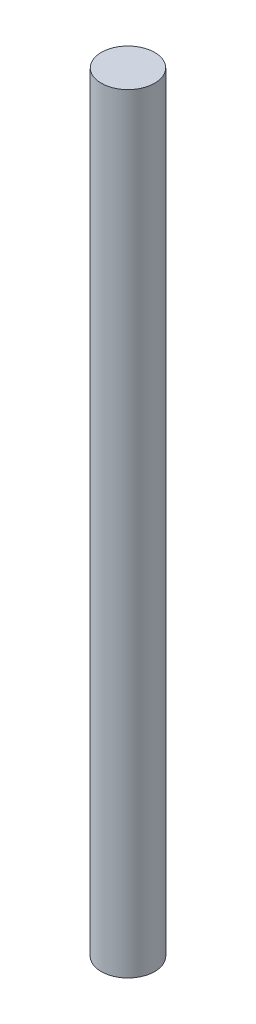
ISO-10303-21;
HEADER;
FILE_DESCRIPTION(('STEP AP214'),'2;1');
FILE_NAME('part.step','',(''),(''),'','','');
FILE_SCHEMA(('AUTOMOTIVE_DESIGN { 1 0 10303 214 1 1 1 1 }'));
ENDSEC;
DATA;
#1=APPLICATION_CONTEXT('core data for automotive mechanical design processes');
#2=APPLICATION_PROTOCOL_DEFINITION('international standard','automotive_design',2000,#1);
#3=PRODUCT_CONTEXT('',#1,'mechanical');
#4=PRODUCT('Part','Part','',(#3));
#5=PRODUCT_RELATED_PRODUCT_CATEGORY('part','',(#4));
#6=PRODUCT_DEFINITION_FORMATION('','',#4);
#7=PRODUCT_DEFINITION_CONTEXT('part definition',#1,'design');
#8=PRODUCT_DEFINITION('design','',#6,#7);
#9=PRODUCT_DEFINITION_SHAPE('','',#8);
#10=(LENGTH_UNIT() NAMED_UNIT(*) SI_UNIT(.MILLI.,.METRE.));
#11=(NAMED_UNIT(*) PLANE_ANGLE_UNIT() SI_UNIT($,.RADIAN.));
#12=(NAMED_UNIT(*) SI_UNIT($,.STERADIAN.) SOLID_ANGLE_UNIT());
#13=UNCERTAINTY_MEASURE_WITH_UNIT(LENGTH_MEASURE(1.E-05),#10,'distance_accuracy_value','');
#14=(GEOMETRIC_REPRESENTATION_CONTEXT(3) GLOBAL_UNCERTAINTY_ASSIGNED_CONTEXT((#13)) GLOBAL_UNIT_ASSIGNED_CONTEXT((#10,
#11,#12)) REPRESENTATION_CONTEXT('',''));
#15=CARTESIAN_POINT('',(0.,0.,0.));
#16=DIRECTION('',(0.,0.,1.));
#17=DIRECTION('',(1.,0.,0.));
#18=AXIS2_PLACEMENT_3D('',#15,#16,#17);
#19=CARTESIAN_POINT('',(0.,45.72,0.));
#20=DIRECTION('',(0.,-1.,0.));
#21=DIRECTION('',(0.,0.,-1.));
#22=AXIS2_PLACEMENT_3D('',#19,#20,#21);
#23=CYLINDRICAL_SURFACE('',#22,1.5875);
#24=CARTESIAN_POINT('',(0.,45.72,0.));
#25=DIRECTION('',(0.,1.,0.));
#26=DIRECTION('',(0.,0.,1.));
#27=AXIS2_PLACEMENT_3D('',#24,#25,#26);
#28=CIRCLE('',#27,1.5875);
#29=CARTESIAN_POINT('',(0.,45.72,1.5875));
#30=VERTEX_POINT('',#29);
#31=EDGE_CURVE('E10',#30,#30,#28,.T.);
#32=ORIENTED_EDGE('',*,*,#31,.F.);
#33=EDGE_LOOP('',(#32));
#34=FACE_BOUND('',#33,.T.);
#35=CARTESIAN_POINT('',(0.,0.,0.));
#36=DIRECTION('',(0.,1.,0.));
#37=DIRECTION('',(0.,0.,1.));
#38=AXIS2_PLACEMENT_3D('',#35,#36,#37);
#39=CIRCLE('',#38,1.5875);
#40=CARTESIAN_POINT('',(0.,0.,1.5875));
#41=VERTEX_POINT('',#40);
#42=EDGE_CURVE('E36',#41,#41,#39,.T.);
#43=ORIENTED_EDGE('',*,*,#42,.T.);
#44=EDGE_LOOP('',(#43));
#45=FACE_BOUND('',#44,.T.);
#46=ADVANCED_FACE('F33',(#34,#45),#23,.T.);
#47=CARTESIAN_POINT('',(0.,45.72,0.));
#48=DIRECTION('',(0.,1.,0.));
#49=DIRECTION('',(0.,0.,1.));
#50=AXIS2_PLACEMENT_3D('',#47,#48,#49);
#51=PLANE('',#50);
#52=ORIENTED_EDGE('',*,*,#31,.T.);
#53=EDGE_LOOP('',(#52));
#54=FACE_BOUND('',#53,.T.);
#55=ADVANCED_FACE('F48',(#54),#51,.T.);
#56=CARTESIAN_POINT('',(0.,0.,0.));
#57=DIRECTION('',(0.,1.,0.));
#58=DIRECTION('',(0.,0.,1.));
#59=AXIS2_PLACEMENT_3D('',#56,#57,#58);
#60=PLANE('',#59);
#61=ORIENTED_EDGE('',*,*,#42,.F.);
#62=EDGE_LOOP('',(#61));
#63=FACE_BOUND('',#62,.T.);
#64=ADVANCED_FACE('F46',(#63),#60,.F.);
#65=CLOSED_SHELL('',(#46,#55,#64));
#66=MANIFOLD_SOLID_BREP('B2',#65);
#67=ADVANCED_BREP_SHAPE_REPRESENTATION('',(#18,#66),#14);
#68=SHAPE_DEFINITION_REPRESENTATION(#9,#67);
ENDSEC;
END-ISO-10303-21;
